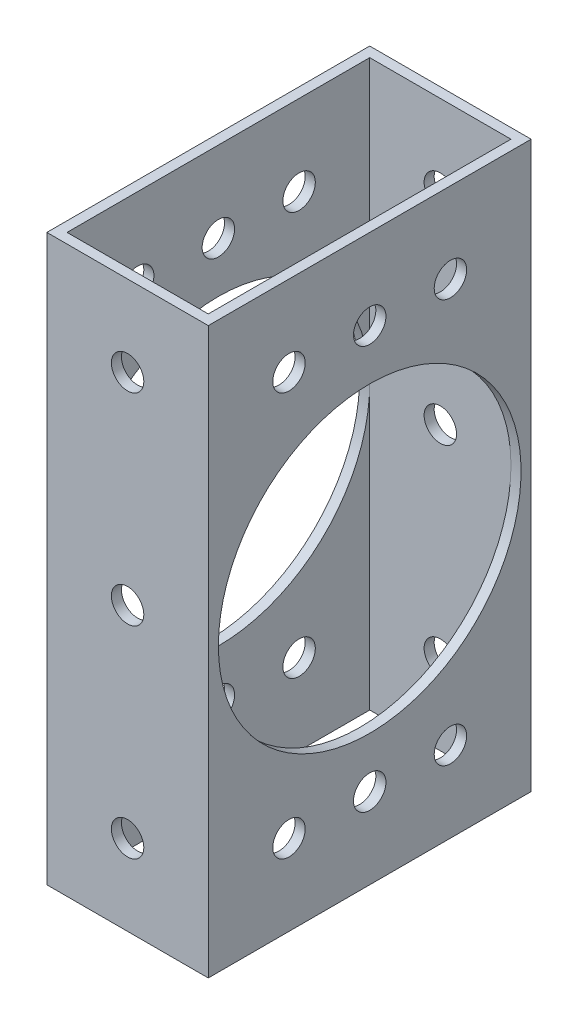
ISO-10303-21;
HEADER;
FILE_DESCRIPTION(('STEP AP214'),'2;1');
FILE_NAME('part.step','',(''),(''),'','','');
FILE_SCHEMA(('AUTOMOTIVE_DESIGN { 1 0 10303 214 1 1 1 1 }'));
ENDSEC;
DATA;
#1=APPLICATION_CONTEXT('core data for automotive mechanical design processes');
#2=APPLICATION_PROTOCOL_DEFINITION('international standard','automotive_design',2000,#1);
#3=PRODUCT_CONTEXT('',#1,'mechanical');
#4=PRODUCT('Part','Part','',(#3));
#5=PRODUCT_RELATED_PRODUCT_CATEGORY('part','',(#4));
#6=PRODUCT_DEFINITION_FORMATION('','',#4);
#7=PRODUCT_DEFINITION_CONTEXT('part definition',#1,'design');
#8=PRODUCT_DEFINITION('design','',#6,#7);
#9=PRODUCT_DEFINITION_SHAPE('','',#8);
#10=(LENGTH_UNIT() NAMED_UNIT(*) SI_UNIT(.MILLI.,.METRE.));
#11=(NAMED_UNIT(*) PLANE_ANGLE_UNIT() SI_UNIT($,.RADIAN.));
#12=(NAMED_UNIT(*) SI_UNIT($,.STERADIAN.) SOLID_ANGLE_UNIT());
#13=UNCERTAINTY_MEASURE_WITH_UNIT(LENGTH_MEASURE(1.E-05),#10,'distance_accuracy_value','');
#14=(GEOMETRIC_REPRESENTATION_CONTEXT(3) GLOBAL_UNCERTAINTY_ASSIGNED_CONTEXT((#13)) GLOBAL_UNIT_ASSIGNED_CONTEXT((#10,
#11,#12)) REPRESENTATION_CONTEXT('',''));
#15=CARTESIAN_POINT('',(0.,0.,0.));
#16=DIRECTION('',(0.,0.,1.));
#17=DIRECTION('',(1.,0.,0.));
#18=AXIS2_PLACEMENT_3D('',#15,#16,#17);
#19=CARTESIAN_POINT('',(11.1125,145.696126628495,0.));
#20=DIRECTION('',(-1.,0.,0.));
#21=DIRECTION('',(0.,0.,1.));
#22=AXIS2_PLACEMENT_3D('',#19,#20,#21);
#23=PLANE('',#22);
#24=CARTESIAN_POINT('',(11.1125,44.45,0.));
#25=DIRECTION('',(-1.,0.,0.));
#26=DIRECTION('',(0.,0.,1.));
#27=AXIS2_PLACEMENT_3D('',#24,#25,#26);
#28=CIRCLE('',#27,23.8125);
#29=CARTESIAN_POINT('',(11.1125,44.45,23.8125));
#30=VERTEX_POINT('',#29);
#31=CARTESIAN_POINT('',(11.1125,44.45,-23.8125));
#32=VERTEX_POINT('',#31);
#33=EDGE_CURVE('E91',#30,#32,#28,.T.);
#34=ORIENTED_EDGE('',*,*,#33,.F.);
#35=DIRECTION('',(0.,-1.,0.));
#36=VECTOR('',#35,1.);
#37=CARTESIAN_POINT('',(11.1125,145.696126628495,23.8125));
#38=LINE('',#37,#36);
#39=CARTESIAN_POINT('',(11.1125,88.9,23.8125));
#40=VERTEX_POINT('',#39);
#41=EDGE_CURVE('E233',#40,#30,#38,.T.);
#42=ORIENTED_EDGE('',*,*,#41,.F.);
#43=DIRECTION('',(0.,0.,-1.));
#44=VECTOR('',#43,1.);
#45=CARTESIAN_POINT('',(11.1125,88.9,0.));
#46=LINE('',#45,#44);
#47=CARTESIAN_POINT('',(11.1125,88.9,-23.8125));
#48=VERTEX_POINT('',#47);
#49=EDGE_CURVE('E459',#40,#48,#46,.T.);
#50=ORIENTED_EDGE('',*,*,#49,.T.);
#51=DIRECTION('',(0.,-1.,0.));
#52=VECTOR('',#51,1.);
#53=CARTESIAN_POINT('',(11.1125,145.696126628495,-23.8125));
#54=LINE('',#53,#52);
#55=EDGE_CURVE('E225',#48,#32,#54,.T.);
#56=ORIENTED_EDGE('',*,*,#55,.T.);
#57=EDGE_LOOP('',(#34,#42,#50,#56));
#58=FACE_BOUND('',#57,.T.);
#59=CARTESIAN_POINT('',(11.1125,76.2,12.7));
#60=DIRECTION('',(-1.,0.,0.));
#61=DIRECTION('',(0.,0.,1.));
#62=AXIS2_PLACEMENT_3D('',#59,#60,#61);
#63=CIRCLE('',#62,2.55269999999999);
#64=CARTESIAN_POINT('',(11.1125,76.2,15.2527));
#65=VERTEX_POINT('',#64);
#66=EDGE_CURVE('E273',#65,#65,#63,.T.);
#67=ORIENTED_EDGE('',*,*,#66,.F.);
#68=EDGE_LOOP('',(#67));
#69=FACE_BOUND('',#68,.T.);
#70=CARTESIAN_POINT('',(11.1125,76.2,0.));
#71=DIRECTION('',(-1.,0.,0.));
#72=DIRECTION('',(0.,0.,1.));
#73=AXIS2_PLACEMENT_3D('',#70,#71,#72);
#74=CIRCLE('',#73,2.55269999999999);
#75=CARTESIAN_POINT('',(11.1125,76.2,2.55269999999999));
#76=VERTEX_POINT('',#75);
#77=EDGE_CURVE('E403',#76,#76,#74,.T.);
#78=ORIENTED_EDGE('',*,*,#77,.F.);
#79=EDGE_LOOP('',(#78));
#80=FACE_BOUND('',#79,.T.);
#81=CARTESIAN_POINT('',(11.1125,76.2,-12.7));
#82=DIRECTION('',(-1.,0.,0.));
#83=DIRECTION('',(0.,0.,1.));
#84=AXIS2_PLACEMENT_3D('',#81,#82,#83);
#85=CIRCLE('',#84,2.55269999999999);
#86=CARTESIAN_POINT('',(11.1125,76.2,-10.1473));
#87=VERTEX_POINT('',#86);
#88=EDGE_CURVE('E387',#87,#87,#85,.T.);
#89=ORIENTED_EDGE('',*,*,#88,.F.);
#90=EDGE_LOOP('',(#89));
#91=FACE_BOUND('',#90,.T.);
#92=ADVANCED_FACE('F71',(#58,#69,#80,#91),#23,.T.);
#93=CARTESIAN_POINT('',(-11.1125,145.696126628495,0.));
#94=DIRECTION('',(1.,0.,0.));
#95=DIRECTION('',(0.,0.,-1.));
#96=AXIS2_PLACEMENT_3D('',#93,#94,#95);
#97=PLANE('',#96);
#98=CARTESIAN_POINT('',(-11.1125,44.45,0.));
#99=DIRECTION('',(1.,0.,0.));
#100=DIRECTION('',(0.,0.,-1.));
#101=AXIS2_PLACEMENT_3D('',#98,#99,#100);
#102=CIRCLE('',#101,23.8125);
#103=CARTESIAN_POINT('',(-11.1125,44.45,-23.8125));
#104=VERTEX_POINT('',#103);
#105=CARTESIAN_POINT('',(-11.1125,44.45,23.8125));
#106=VERTEX_POINT('',#105);
#107=EDGE_CURVE('E100',#104,#106,#102,.T.);
#108=ORIENTED_EDGE('',*,*,#107,.F.);
#109=DIRECTION('',(0.,-1.,0.));
#110=VECTOR('',#109,1.);
#111=CARTESIAN_POINT('',(-11.1125,145.696126628495,-23.8125));
#112=LINE('',#111,#110);
#113=CARTESIAN_POINT('',(-11.1125,88.9,-23.8125));
#114=VERTEX_POINT('',#113);
#115=EDGE_CURVE('E200',#114,#104,#112,.T.);
#116=ORIENTED_EDGE('',*,*,#115,.F.);
#117=DIRECTION('',(0.,0.,1.));
#118=VECTOR('',#117,1.);
#119=CARTESIAN_POINT('',(-11.1125,88.9,0.));
#120=LINE('',#119,#118);
#121=CARTESIAN_POINT('',(-11.1125,88.9,23.8125));
#122=VERTEX_POINT('',#121);
#123=EDGE_CURVE('E467',#114,#122,#120,.T.);
#124=ORIENTED_EDGE('',*,*,#123,.T.);
#125=DIRECTION('',(0.,-1.,0.));
#126=VECTOR('',#125,1.);
#127=CARTESIAN_POINT('',(-11.1125,145.696126628495,23.8125));
#128=LINE('',#127,#126);
#129=EDGE_CURVE('E202',#122,#106,#128,.T.);
#130=ORIENTED_EDGE('',*,*,#129,.T.);
#131=EDGE_LOOP('',(#108,#116,#124,#130));
#132=FACE_BOUND('',#131,.T.);
#133=CARTESIAN_POINT('',(-11.1125,76.2,12.7));
#134=DIRECTION('',(1.,0.,0.));
#135=DIRECTION('',(0.,0.,-1.));
#136=AXIS2_PLACEMENT_3D('',#133,#134,#135);
#137=CIRCLE('',#136,2.55269999999999);
#138=CARTESIAN_POINT('',(-11.1125,76.2,10.1473));
#139=VERTEX_POINT('',#138);
#140=EDGE_CURVE('E277',#139,#139,#137,.T.);
#141=ORIENTED_EDGE('',*,*,#140,.F.);
#142=EDGE_LOOP('',(#141));
#143=FACE_BOUND('',#142,.T.);
#144=CARTESIAN_POINT('',(-11.1125,76.2,0.));
#145=DIRECTION('',(1.,0.,0.));
#146=DIRECTION('',(0.,0.,-1.));
#147=AXIS2_PLACEMENT_3D('',#144,#145,#146);
#148=CIRCLE('',#147,2.55269999999999);
#149=CARTESIAN_POINT('',(-11.1125,76.2,-2.55269999999999));
#150=VERTEX_POINT('',#149);
#151=EDGE_CURVE('E399',#150,#150,#148,.T.);
#152=ORIENTED_EDGE('',*,*,#151,.F.);
#153=EDGE_LOOP('',(#152));
#154=FACE_BOUND('',#153,.T.);
#155=CARTESIAN_POINT('',(-11.1125,76.2,-12.7));
#156=DIRECTION('',(1.,0.,0.));
#157=DIRECTION('',(0.,0.,-1.));
#158=AXIS2_PLACEMENT_3D('',#155,#156,#157);
#159=CIRCLE('',#158,2.55269999999999);
#160=CARTESIAN_POINT('',(-11.1125,76.2,-15.2527));
#161=VERTEX_POINT('',#160);
#162=EDGE_CURVE('E383',#161,#161,#159,.T.);
#163=ORIENTED_EDGE('',*,*,#162,.F.);
#164=EDGE_LOOP('',(#163));
#165=FACE_BOUND('',#164,.T.);
#166=ADVANCED_FACE('F196',(#132,#143,#154,#165),#97,.T.);
#167=CARTESIAN_POINT('',(12.7,145.696126628495,-25.4));
#168=DIRECTION('',(0.,0.,1.));
#169=DIRECTION('',(1.,0.,0.));
#170=AXIS2_PLACEMENT_3D('',#167,#168,#169);
#171=PLANE('',#170);
#172=CARTESIAN_POINT('',(0.,12.7,-25.4));
#173=DIRECTION('',(0.,0.,1.));
#174=DIRECTION('',(1.,0.,0.));
#175=AXIS2_PLACEMENT_3D('',#172,#173,#174);
#176=CIRCLE('',#175,2.55269999999999);
#177=CARTESIAN_POINT('',(2.55269999999999,12.7,-25.4));
#178=VERTEX_POINT('',#177);
#179=EDGE_CURVE('E516',#178,#178,#176,.T.);
#180=ORIENTED_EDGE('',*,*,#179,.T.);
#181=EDGE_LOOP('',(#180));
#182=FACE_BOUND('',#181,.T.);
#183=CARTESIAN_POINT('',(0.,76.2,-25.4));
#184=DIRECTION('',(0.,0.,1.));
#185=DIRECTION('',(1.,0.,0.));
#186=AXIS2_PLACEMENT_3D('',#183,#184,#185);
#187=CIRCLE('',#186,2.55269999999999);
#188=CARTESIAN_POINT('',(2.55269999999999,76.2,-25.4));
#189=VERTEX_POINT('',#188);
#190=EDGE_CURVE('E539',#189,#189,#187,.T.);
#191=ORIENTED_EDGE('',*,*,#190,.T.);
#192=EDGE_LOOP('',(#191));
#193=FACE_BOUND('',#192,.T.);
#194=CARTESIAN_POINT('',(0.,44.45,-25.4));
#195=DIRECTION('',(0.,0.,1.));
#196=DIRECTION('',(1.,0.,0.));
#197=AXIS2_PLACEMENT_3D('',#194,#195,#196);
#198=CIRCLE('',#197,2.55269999999999);
#199=CARTESIAN_POINT('',(2.55269999999999,44.45,-25.4));
#200=VERTEX_POINT('',#199);
#201=EDGE_CURVE('E364',#200,#200,#198,.T.);
#202=ORIENTED_EDGE('',*,*,#201,.T.);
#203=EDGE_LOOP('',(#202));
#204=FACE_BOUND('',#203,.T.);
#205=DIRECTION('',(-1.,0.,0.));
#206=VECTOR('',#205,1.);
#207=CARTESIAN_POINT('',(12.7,88.9,-25.4));
#208=LINE('',#207,#206);
#209=CARTESIAN_POINT('',(12.7,88.9,-25.4));
#210=VERTEX_POINT('',#209);
#211=CARTESIAN_POINT('',(-12.7,88.9,-25.4));
#212=VERTEX_POINT('',#211);
#213=EDGE_CURVE('E470',#210,#212,#208,.T.);
#214=ORIENTED_EDGE('',*,*,#213,.F.);
#215=DIRECTION('',(0.,-1.,0.));
#216=VECTOR('',#215,1.);
#217=CARTESIAN_POINT('',(12.7,145.696126628495,-25.4));
#218=LINE('',#217,#216);
#219=CARTESIAN_POINT('',(12.7,0.,-25.4));
#220=VERTEX_POINT('',#219);
#221=EDGE_CURVE('E259',#210,#220,#218,.T.);
#222=ORIENTED_EDGE('',*,*,#221,.T.);
#223=DIRECTION('',(-1.,0.,0.));
#224=VECTOR('',#223,1.);
#225=CARTESIAN_POINT('',(12.7,0.,-25.4));
#226=LINE('',#225,#224);
#227=CARTESIAN_POINT('',(-12.7,0.,-25.4));
#228=VERTEX_POINT('',#227);
#229=EDGE_CURVE('E252',#220,#228,#226,.T.);
#230=ORIENTED_EDGE('',*,*,#229,.T.);
#231=DIRECTION('',(0.,-1.,0.));
#232=VECTOR('',#231,1.);
#233=CARTESIAN_POINT('',(-12.7,145.696126628495,-25.4));
#234=LINE('',#233,#232);
#235=EDGE_CURVE('E256',#212,#228,#234,.T.);
#236=ORIENTED_EDGE('',*,*,#235,.F.);
#237=EDGE_LOOP('',(#214,#222,#230,#236));
#238=FACE_BOUND('',#237,.T.);
#239=ADVANCED_FACE('F571',(#182,#193,#204,#238),#171,.F.);
#240=CARTESIAN_POINT('',(12.7,145.696126628495,-25.4));
#241=DIRECTION('',(-1.,0.,0.));
#242=DIRECTION('',(0.,0.,1.));
#243=AXIS2_PLACEMENT_3D('',#240,#241,#242);
#244=PLANE('',#243);
#245=CARTESIAN_POINT('',(12.7,44.45,0.));
#246=DIRECTION('',(-1.,0.,0.));
#247=DIRECTION('',(0.,0.,1.));
#248=AXIS2_PLACEMENT_3D('',#245,#246,#247);
#249=CIRCLE('',#248,23.8125);
#250=CARTESIAN_POINT('',(12.7,44.45,23.8125));
#251=VERTEX_POINT('',#250);
#252=EDGE_CURVE('E191',#251,#251,#249,.T.);
#253=ORIENTED_EDGE('',*,*,#252,.T.);
#254=EDGE_LOOP('',(#253));
#255=FACE_BOUND('',#254,.T.);
#256=CARTESIAN_POINT('',(12.7,76.2,-12.7));
#257=DIRECTION('',(-1.,0.,0.));
#258=DIRECTION('',(0.,0.,1.));
#259=AXIS2_PLACEMENT_3D('',#256,#257,#258);
#260=CIRCLE('',#259,2.55269999999999);
#261=CARTESIAN_POINT('',(12.7,76.2,-10.1473));
#262=VERTEX_POINT('',#261);
#263=EDGE_CURVE('E379',#262,#262,#260,.T.);
#264=ORIENTED_EDGE('',*,*,#263,.T.);
#265=EDGE_LOOP('',(#264));
#266=FACE_BOUND('',#265,.T.);
#267=CARTESIAN_POINT('',(12.7,76.2,0.));
#268=DIRECTION('',(-1.,0.,0.));
#269=DIRECTION('',(0.,0.,1.));
#270=AXIS2_PLACEMENT_3D('',#267,#268,#269);
#271=CIRCLE('',#270,2.55269999999999);
#272=CARTESIAN_POINT('',(12.7,76.2,2.55269999999999));
#273=VERTEX_POINT('',#272);
#274=EDGE_CURVE('E395',#273,#273,#271,.T.);
#275=ORIENTED_EDGE('',*,*,#274,.T.);
#276=EDGE_LOOP('',(#275));
#277=FACE_BOUND('',#276,.T.);
#278=CARTESIAN_POINT('',(12.7,76.2,12.7));
#279=DIRECTION('',(-1.,0.,0.));
#280=DIRECTION('',(0.,0.,1.));
#281=AXIS2_PLACEMENT_3D('',#278,#279,#280);
#282=CIRCLE('',#281,2.55269999999999);
#283=CARTESIAN_POINT('',(12.7,76.2,15.2527));
#284=VERTEX_POINT('',#283);
#285=EDGE_CURVE('E278',#284,#284,#282,.T.);
#286=ORIENTED_EDGE('',*,*,#285,.T.);
#287=EDGE_LOOP('',(#286));
#288=FACE_BOUND('',#287,.T.);
#289=CARTESIAN_POINT('',(12.7,12.7,-12.7));
#290=DIRECTION('',(-1.,0.,0.));
#291=DIRECTION('',(0.,0.,1.));
#292=AXIS2_PLACEMENT_3D('',#289,#290,#291);
#293=CIRCLE('',#292,2.55269999999999);
#294=CARTESIAN_POINT('',(12.7,12.7,-10.1473));
#295=VERTEX_POINT('',#294);
#296=EDGE_CURVE('E272',#295,#295,#293,.T.);
#297=ORIENTED_EDGE('',*,*,#296,.T.);
#298=EDGE_LOOP('',(#297));
#299=FACE_BOUND('',#298,.T.);
#300=CARTESIAN_POINT('',(12.7,12.7,0.));
#301=DIRECTION('',(-1.,0.,0.));
#302=DIRECTION('',(0.,0.,1.));
#303=AXIS2_PLACEMENT_3D('',#300,#301,#302);
#304=CIRCLE('',#303,2.55269999999999);
#305=CARTESIAN_POINT('',(12.7,12.7,2.55269999999999));
#306=VERTEX_POINT('',#305);
#307=EDGE_CURVE('E431',#306,#306,#304,.T.);
#308=ORIENTED_EDGE('',*,*,#307,.T.);
#309=EDGE_LOOP('',(#308));
#310=FACE_BOUND('',#309,.T.);
#311=CARTESIAN_POINT('',(12.7,12.7,12.7));
#312=DIRECTION('',(-1.,0.,0.));
#313=DIRECTION('',(0.,0.,1.));
#314=AXIS2_PLACEMENT_3D('',#311,#312,#313);
#315=CIRCLE('',#314,2.55269999999999);
#316=CARTESIAN_POINT('',(12.7,12.7,15.2527));
#317=VERTEX_POINT('',#316);
#318=EDGE_CURVE('E447',#317,#317,#315,.T.);
#319=ORIENTED_EDGE('',*,*,#318,.T.);
#320=EDGE_LOOP('',(#319));
#321=FACE_BOUND('',#320,.T.);
#322=DIRECTION('',(0.,0.,-1.));
#323=VECTOR('',#322,1.);
#324=CARTESIAN_POINT('',(12.7,88.9,-25.4));
#325=LINE('',#324,#323);
#326=CARTESIAN_POINT('',(12.7,88.9,25.4));
#327=VERTEX_POINT('',#326);
#328=EDGE_CURVE('E474',#327,#210,#325,.T.);
#329=ORIENTED_EDGE('',*,*,#328,.F.);
#330=DIRECTION('',(0.,-1.,0.));
#331=VECTOR('',#330,1.);
#332=CARTESIAN_POINT('',(12.7,145.696126628495,25.4));
#333=LINE('',#332,#331);
#334=CARTESIAN_POINT('',(12.7,0.,25.4));
#335=VERTEX_POINT('',#334);
#336=EDGE_CURVE('E262',#327,#335,#333,.T.);
#337=ORIENTED_EDGE('',*,*,#336,.T.);
#338=DIRECTION('',(0.,0.,-1.));
#339=VECTOR('',#338,1.);
#340=CARTESIAN_POINT('',(12.7,0.,-25.4));
#341=LINE('',#340,#339);
#342=EDGE_CURVE('E248',#335,#220,#341,.T.);
#343=ORIENTED_EDGE('',*,*,#342,.T.);
#344=ORIENTED_EDGE('',*,*,#221,.F.);
#345=EDGE_LOOP('',(#329,#337,#343,#344));
#346=FACE_BOUND('',#345,.T.);
#347=ADVANCED_FACE('F559',(#255,#266,#277,#288,#299,#310,#321,#346),#244,.F.);
#348=CARTESIAN_POINT('',(12.7,145.696126628495,25.4));
#349=DIRECTION('',(0.,0.,-1.));
#350=DIRECTION('',(-1.,0.,0.));
#351=AXIS2_PLACEMENT_3D('',#348,#349,#350);
#352=PLANE('',#351);
#353=CARTESIAN_POINT('',(0.,12.7,25.4));
#354=DIRECTION('',(0.,0.,1.));
#355=DIRECTION('',(1.,0.,0.));
#356=AXIS2_PLACEMENT_3D('',#353,#354,#355);
#357=CIRCLE('',#356,2.55269999999999);
#358=CARTESIAN_POINT('',(2.55269999999999,12.7,25.4));
#359=VERTEX_POINT('',#358);
#360=EDGE_CURVE('E518',#359,#359,#357,.T.);
#361=ORIENTED_EDGE('',*,*,#360,.F.);
#362=EDGE_LOOP('',(#361));
#363=FACE_BOUND('',#362,.T.);
#364=CARTESIAN_POINT('',(0.,76.2,25.4));
#365=DIRECTION('',(0.,0.,1.));
#366=DIRECTION('',(1.,0.,0.));
#367=AXIS2_PLACEMENT_3D('',#364,#365,#366);
#368=CIRCLE('',#367,2.55269999999999);
#369=CARTESIAN_POINT('',(2.55269999999999,76.2,25.4));
#370=VERTEX_POINT('',#369);
#371=EDGE_CURVE('E513',#370,#370,#368,.T.);
#372=ORIENTED_EDGE('',*,*,#371,.F.);
#373=EDGE_LOOP('',(#372));
#374=FACE_BOUND('',#373,.T.);
#375=CARTESIAN_POINT('',(0.,44.45,25.4));
#376=DIRECTION('',(0.,0.,1.));
#377=DIRECTION('',(1.,0.,0.));
#378=AXIS2_PLACEMENT_3D('',#375,#376,#377);
#379=CIRCLE('',#378,2.55269999999999);
#380=CARTESIAN_POINT('',(2.55269999999999,44.45,25.4));
#381=VERTEX_POINT('',#380);
#382=EDGE_CURVE('E366',#381,#381,#379,.T.);
#383=ORIENTED_EDGE('',*,*,#382,.F.);
#384=EDGE_LOOP('',(#383));
#385=FACE_BOUND('',#384,.T.);
#386=DIRECTION('',(1.,0.,0.));
#387=VECTOR('',#386,1.);
#388=CARTESIAN_POINT('',(12.7,88.9,25.4));
#389=LINE('',#388,#387);
#390=CARTESIAN_POINT('',(-12.7,88.9,25.4));
#391=VERTEX_POINT('',#390);
#392=EDGE_CURVE('E478',#391,#327,#389,.T.);
#393=ORIENTED_EDGE('',*,*,#392,.F.);
#394=DIRECTION('',(0.,-1.,0.));
#395=VECTOR('',#394,1.);
#396=CARTESIAN_POINT('',(-12.7,145.696126628495,25.4));
#397=LINE('',#396,#395);
#398=CARTESIAN_POINT('',(-12.7,0.,25.4));
#399=VERTEX_POINT('',#398);
#400=EDGE_CURVE('E81',#391,#399,#397,.T.);
#401=ORIENTED_EDGE('',*,*,#400,.T.);
#402=DIRECTION('',(1.,0.,0.));
#403=VECTOR('',#402,1.);
#404=CARTESIAN_POINT('',(12.7,0.,25.4));
#405=LINE('',#404,#403);
#406=EDGE_CURVE('E244',#399,#335,#405,.T.);
#407=ORIENTED_EDGE('',*,*,#406,.T.);
#408=ORIENTED_EDGE('',*,*,#336,.F.);
#409=EDGE_LOOP('',(#393,#401,#407,#408));
#410=FACE_BOUND('',#409,.T.);
#411=ADVANCED_FACE('F556',(#363,#374,#385,#410),#352,.F.);
#412=CARTESIAN_POINT('',(-12.7,145.696126628495,-25.4));
#413=DIRECTION('',(1.,0.,0.));
#414=DIRECTION('',(0.,0.,-1.));
#415=AXIS2_PLACEMENT_3D('',#412,#413,#414);
#416=PLANE('',#415);
#417=CARTESIAN_POINT('',(-12.7,44.45,0.));
#418=DIRECTION('',(-1.,0.,0.));
#419=DIRECTION('',(0.,0.,1.));
#420=AXIS2_PLACEMENT_3D('',#417,#418,#419);
#421=CIRCLE('',#420,23.8125);
#422=CARTESIAN_POINT('',(-12.7,44.45,23.8125));
#423=VERTEX_POINT('',#422);
#424=EDGE_CURVE('E522',#423,#423,#421,.T.);
#425=ORIENTED_EDGE('',*,*,#424,.F.);
#426=EDGE_LOOP('',(#425));
#427=FACE_BOUND('',#426,.T.);
#428=CARTESIAN_POINT('',(-12.7,76.2,-12.7));
#429=DIRECTION('',(-1.,0.,0.));
#430=DIRECTION('',(0.,0.,1.));
#431=AXIS2_PLACEMENT_3D('',#428,#429,#430);
#432=CIRCLE('',#431,2.55269999999999);
#433=CARTESIAN_POINT('',(-12.7,76.2,-10.1473));
#434=VERTEX_POINT('',#433);
#435=EDGE_CURVE('E361',#434,#434,#432,.T.);
#436=ORIENTED_EDGE('',*,*,#435,.F.);
#437=EDGE_LOOP('',(#436));
#438=FACE_BOUND('',#437,.T.);
#439=CARTESIAN_POINT('',(-12.7,76.2,0.));
#440=DIRECTION('',(-1.,0.,0.));
#441=DIRECTION('',(0.,0.,1.));
#442=AXIS2_PLACEMENT_3D('',#439,#440,#441);
#443=CIRCLE('',#442,2.55269999999999);
#444=CARTESIAN_POINT('',(-12.7,76.2,2.55269999999999));
#445=VERTEX_POINT('',#444);
#446=EDGE_CURVE('E391',#445,#445,#443,.T.);
#447=ORIENTED_EDGE('',*,*,#446,.F.);
#448=EDGE_LOOP('',(#447));
#449=FACE_BOUND('',#448,.T.);
#450=CARTESIAN_POINT('',(-12.7,76.2,12.7));
#451=DIRECTION('',(-1.,0.,0.));
#452=DIRECTION('',(0.,0.,1.));
#453=AXIS2_PLACEMENT_3D('',#450,#451,#452);
#454=CIRCLE('',#453,2.55269999999999);
#455=CARTESIAN_POINT('',(-12.7,76.2,15.2527));
#456=VERTEX_POINT('',#455);
#457=EDGE_CURVE('E407',#456,#456,#454,.T.);
#458=ORIENTED_EDGE('',*,*,#457,.F.);
#459=EDGE_LOOP('',(#458));
#460=FACE_BOUND('',#459,.T.);
#461=CARTESIAN_POINT('',(-12.7,12.7,-12.7));
#462=DIRECTION('',(-1.,0.,0.));
#463=DIRECTION('',(0.,0.,1.));
#464=AXIS2_PLACEMENT_3D('',#461,#462,#463);
#465=CIRCLE('',#464,2.55269999999999);
#466=CARTESIAN_POINT('',(-12.7,12.7,-10.1473));
#467=VERTEX_POINT('',#466);
#468=EDGE_CURVE('E417',#467,#467,#465,.T.);
#469=ORIENTED_EDGE('',*,*,#468,.F.);
#470=EDGE_LOOP('',(#469));
#471=FACE_BOUND('',#470,.T.);
#472=CARTESIAN_POINT('',(-12.7,12.7,0.));
#473=DIRECTION('',(-1.,0.,0.));
#474=DIRECTION('',(0.,0.,1.));
#475=AXIS2_PLACEMENT_3D('',#472,#473,#474);
#476=CIRCLE('',#475,2.55269999999999);
#477=CARTESIAN_POINT('',(-12.7,12.7,2.55269999999999));
#478=VERTEX_POINT('',#477);
#479=EDGE_CURVE('E427',#478,#478,#476,.T.);
#480=ORIENTED_EDGE('',*,*,#479,.F.);
#481=EDGE_LOOP('',(#480));
#482=FACE_BOUND('',#481,.T.);
#483=CARTESIAN_POINT('',(-12.7,12.7,12.7));
#484=DIRECTION('',(-1.,0.,0.));
#485=DIRECTION('',(0.,0.,1.));
#486=AXIS2_PLACEMENT_3D('',#483,#484,#485);
#487=CIRCLE('',#486,2.55269999999999);
#488=CARTESIAN_POINT('',(-12.7,12.7,15.2527));
#489=VERTEX_POINT('',#488);
#490=EDGE_CURVE('E443',#489,#489,#487,.T.);
#491=ORIENTED_EDGE('',*,*,#490,.F.);
#492=EDGE_LOOP('',(#491));
#493=FACE_BOUND('',#492,.T.);
#494=DIRECTION('',(0.,0.,1.));
#495=VECTOR('',#494,1.);
#496=CARTESIAN_POINT('',(-12.7,88.9,-25.4));
#497=LINE('',#496,#495);
#498=EDGE_CURVE('E482',#212,#391,#497,.T.);
#499=ORIENTED_EDGE('',*,*,#498,.F.);
#500=ORIENTED_EDGE('',*,*,#235,.T.);
#501=DIRECTION('',(0.,0.,1.));
#502=VECTOR('',#501,1.);
#503=CARTESIAN_POINT('',(-12.7,0.,-25.4));
#504=LINE('',#503,#502);
#505=EDGE_CURVE('E240',#228,#399,#504,.T.);
#506=ORIENTED_EDGE('',*,*,#505,.T.);
#507=ORIENTED_EDGE('',*,*,#400,.F.);
#508=EDGE_LOOP('',(#499,#500,#506,#507));
#509=FACE_BOUND('',#508,.T.);
#510=ADVANCED_FACE('F73',(#427,#438,#449,#460,#471,#482,#493,#509),#416,.F.);
#511=CARTESIAN_POINT('',(0.,0.,0.));
#512=DIRECTION('',(0.,1.,0.));
#513=DIRECTION('',(0.,0.,1.));
#514=AXIS2_PLACEMENT_3D('',#511,#512,#513);
#515=PLANE('',#514);
#516=ORIENTED_EDGE('',*,*,#505,.F.);
#517=ORIENTED_EDGE('',*,*,#229,.F.);
#518=ORIENTED_EDGE('',*,*,#342,.F.);
#519=ORIENTED_EDGE('',*,*,#406,.F.);
#520=EDGE_LOOP('',(#516,#517,#518,#519));
#521=FACE_BOUND('',#520,.T.);
#522=DIRECTION('',(0.,0.,1.));
#523=VECTOR('',#522,1.);
#524=CARTESIAN_POINT('',(-11.1125,0.,0.));
#525=LINE('',#524,#523);
#526=CARTESIAN_POINT('',(-11.1125,0.,-23.8125));
#527=VERTEX_POINT('',#526);
#528=CARTESIAN_POINT('',(-11.1125,0.,23.8125));
#529=VERTEX_POINT('',#528);
#530=EDGE_CURVE('E210',#527,#529,#525,.T.);
#531=ORIENTED_EDGE('',*,*,#530,.T.);
#532=DIRECTION('',(1.,0.,0.));
#533=VECTOR('',#532,1.);
#534=CARTESIAN_POINT('',(0.,0.,23.8125));
#535=LINE('',#534,#533);
#536=CARTESIAN_POINT('',(11.1125,0.,23.8125));
#537=VERTEX_POINT('',#536);
#538=EDGE_CURVE('E488',#529,#537,#535,.T.);
#539=ORIENTED_EDGE('',*,*,#538,.T.);
#540=DIRECTION('',(0.,0.,-1.));
#541=VECTOR('',#540,1.);
#542=CARTESIAN_POINT('',(11.1125,0.,0.));
#543=LINE('',#542,#541);
#544=CARTESIAN_POINT('',(11.1125,0.,-23.8125));
#545=VERTEX_POINT('',#544);
#546=EDGE_CURVE('E491',#537,#545,#543,.T.);
#547=ORIENTED_EDGE('',*,*,#546,.T.);
#548=DIRECTION('',(-1.,0.,0.));
#549=VECTOR('',#548,1.);
#550=CARTESIAN_POINT('',(0.,0.,-23.8125));
#551=LINE('',#550,#549);
#552=EDGE_CURVE('E215',#545,#527,#551,.T.);
#553=ORIENTED_EDGE('',*,*,#552,.T.);
#554=EDGE_LOOP('',(#531,#539,#547,#553));
#555=FACE_BOUND('',#554,.T.);
#556=ADVANCED_FACE('F337',(#521,#555),#515,.F.);
#557=CARTESIAN_POINT('',(0.,145.696126628495,-23.8125));
#558=DIRECTION('',(0.,0.,1.));
#559=DIRECTION('',(1.,0.,0.));
#560=AXIS2_PLACEMENT_3D('',#557,#558,#559);
#561=PLANE('',#560);
#562=CARTESIAN_POINT('',(0.,44.45,-23.8125));
#563=DIRECTION('',(0.,0.,1.));
#564=DIRECTION('',(1.,0.,0.));
#565=AXIS2_PLACEMENT_3D('',#562,#563,#564);
#566=CIRCLE('',#565,2.55269999999999);
#567=CARTESIAN_POINT('',(2.55269999999999,44.45,-23.8125));
#568=VERTEX_POINT('',#567);
#569=CARTESIAN_POINT('',(-2.55269999999999,44.45,-23.8125));
#570=VERTEX_POINT('',#569);
#571=EDGE_CURVE('E322',#568,#570,#566,.T.);
#572=ORIENTED_EDGE('',*,*,#571,.F.);
#573=CARTESIAN_POINT('',(0.,44.45,-23.8125));
#574=DIRECTION('',(0.,0.,1.));
#575=DIRECTION('',(1.,0.,0.));
#576=AXIS2_PLACEMENT_3D('',#573,#574,#575);
#577=CIRCLE('',#576,2.55269999999999);
#578=EDGE_CURVE('E326',#570,#568,#577,.T.);
#579=ORIENTED_EDGE('',*,*,#578,.F.);
#580=EDGE_LOOP('',(#572,#579));
#581=FACE_BOUND('',#580,.T.);
#582=EDGE_CURVE('E222',#32,#545,#54,.T.);
#583=ORIENTED_EDGE('',*,*,#582,.F.);
#584=ORIENTED_EDGE('',*,*,#55,.F.);
#585=DIRECTION('',(-1.,0.,0.));
#586=VECTOR('',#585,1.);
#587=CARTESIAN_POINT('',(0.,88.9,-23.8125));
#588=LINE('',#587,#586);
#589=EDGE_CURVE('E12',#48,#114,#588,.T.);
#590=ORIENTED_EDGE('',*,*,#589,.T.);
#591=ORIENTED_EDGE('',*,*,#115,.T.);
#592=EDGE_CURVE('E206',#104,#527,#112,.T.);
#593=ORIENTED_EDGE('',*,*,#592,.T.);
#594=ORIENTED_EDGE('',*,*,#552,.F.);
#595=EDGE_LOOP('',(#583,#584,#590,#591,#593,#594));
#596=FACE_BOUND('',#595,.T.);
#597=CARTESIAN_POINT('',(0.,76.2,-23.8125));
#598=DIRECTION('',(0.,0.,1.));
#599=DIRECTION('',(1.,0.,0.));
#600=AXIS2_PLACEMENT_3D('',#597,#598,#599);
#601=CIRCLE('',#600,2.55269999999999);
#602=CARTESIAN_POINT('',(2.55269999999999,76.2,-23.8125));
#603=VERTEX_POINT('',#602);
#604=EDGE_CURVE('E543',#603,#603,#601,.T.);
#605=ORIENTED_EDGE('',*,*,#604,.F.);
#606=EDGE_LOOP('',(#605));
#607=FACE_BOUND('',#606,.T.);
#608=CARTESIAN_POINT('',(0.,12.7,-23.8125));
#609=DIRECTION('',(0.,0.,1.));
#610=DIRECTION('',(1.,0.,0.));
#611=AXIS2_PLACEMENT_3D('',#608,#609,#610);
#612=CIRCLE('',#611,2.55269999999999);
#613=CARTESIAN_POINT('',(2.55269999999999,12.7,-23.8125));
#614=VERTEX_POINT('',#613);
#615=EDGE_CURVE('E510',#614,#614,#612,.T.);
#616=ORIENTED_EDGE('',*,*,#615,.F.);
#617=EDGE_LOOP('',(#616));
#618=FACE_BOUND('',#617,.T.);
#619=ADVANCED_FACE('F218',(#581,#596,#607,#618),#561,.T.);
#620=EDGE_CURVE('E204',#32,#30,#28,.T.);
#621=ORIENTED_EDGE('',*,*,#620,.F.);
#622=ORIENTED_EDGE('',*,*,#582,.T.);
#623=ORIENTED_EDGE('',*,*,#546,.F.);
#624=EDGE_CURVE('E232',#30,#537,#38,.T.);
#625=ORIENTED_EDGE('',*,*,#624,.F.);
#626=EDGE_LOOP('',(#621,#622,#623,#625));
#627=FACE_BOUND('',#626,.T.);
#628=CARTESIAN_POINT('',(11.1125,12.7,-12.7));
#629=DIRECTION('',(-1.,0.,0.));
#630=DIRECTION('',(0.,0.,1.));
#631=AXIS2_PLACEMENT_3D('',#628,#629,#630);
#632=CIRCLE('',#631,2.55269999999999);
#633=CARTESIAN_POINT('',(11.1125,12.7,-10.1473));
#634=VERTEX_POINT('',#633);
#635=EDGE_CURVE('E267',#634,#634,#632,.T.);
#636=ORIENTED_EDGE('',*,*,#635,.F.);
#637=EDGE_LOOP('',(#636));
#638=FACE_BOUND('',#637,.T.);
#639=CARTESIAN_POINT('',(11.1125,12.7,0.));
#640=DIRECTION('',(-1.,0.,0.));
#641=DIRECTION('',(0.,0.,1.));
#642=AXIS2_PLACEMENT_3D('',#639,#640,#641);
#643=CIRCLE('',#642,2.55269999999999);
#644=CARTESIAN_POINT('',(11.1125,12.7,2.55269999999999));
#645=VERTEX_POINT('',#644);
#646=EDGE_CURVE('E439',#645,#645,#643,.T.);
#647=ORIENTED_EDGE('',*,*,#646,.F.);
#648=EDGE_LOOP('',(#647));
#649=FACE_BOUND('',#648,.T.);
#650=CARTESIAN_POINT('',(11.1125,12.7,12.7));
#651=DIRECTION('',(-1.,0.,0.));
#652=DIRECTION('',(0.,0.,1.));
#653=AXIS2_PLACEMENT_3D('',#650,#651,#652);
#654=CIRCLE('',#653,2.55269999999999);
#655=CARTESIAN_POINT('',(11.1125,12.7,15.2527));
#656=VERTEX_POINT('',#655);
#657=EDGE_CURVE('E451',#656,#656,#654,.T.);
#658=ORIENTED_EDGE('',*,*,#657,.F.);
#659=EDGE_LOOP('',(#658));
#660=FACE_BOUND('',#659,.T.);
#661=ADVANCED_FACE('F336',(#627,#638,#649,#660),#23,.T.);
#662=CARTESIAN_POINT('',(0.,145.696126628495,23.8125));
#663=DIRECTION('',(0.,0.,-1.));
#664=DIRECTION('',(-1.,0.,0.));
#665=AXIS2_PLACEMENT_3D('',#662,#663,#664);
#666=PLANE('',#665);
#667=CARTESIAN_POINT('',(0.,44.45,23.8125));
#668=DIRECTION('',(0.,0.,-1.));
#669=DIRECTION('',(-1.,0.,0.));
#670=AXIS2_PLACEMENT_3D('',#667,#668,#669);
#671=CIRCLE('',#670,2.55269999999999);
#672=CARTESIAN_POINT('',(2.55269999999999,44.45,23.8125));
#673=VERTEX_POINT('',#672);
#674=CARTESIAN_POINT('',(-2.55269999999999,44.45,23.8125));
#675=VERTEX_POINT('',#674);
#676=EDGE_CURVE('E352',#673,#675,#671,.T.);
#677=ORIENTED_EDGE('',*,*,#676,.F.);
#678=CARTESIAN_POINT('',(0.,44.45,23.8125));
#679=DIRECTION('',(0.,0.,-1.));
#680=DIRECTION('',(-1.,0.,0.));
#681=AXIS2_PLACEMENT_3D('',#678,#679,#680);
#682=CIRCLE('',#681,2.55269999999999);
#683=EDGE_CURVE('E283',#675,#673,#682,.T.);
#684=ORIENTED_EDGE('',*,*,#683,.F.);
#685=EDGE_LOOP('',(#677,#684));
#686=FACE_BOUND('',#685,.T.);
#687=ORIENTED_EDGE('',*,*,#41,.T.);
#688=ORIENTED_EDGE('',*,*,#624,.T.);
#689=ORIENTED_EDGE('',*,*,#538,.F.);
#690=EDGE_CURVE('E237',#106,#529,#128,.T.);
#691=ORIENTED_EDGE('',*,*,#690,.F.);
#692=ORIENTED_EDGE('',*,*,#129,.F.);
#693=DIRECTION('',(1.,0.,0.));
#694=VECTOR('',#693,1.);
#695=CARTESIAN_POINT('',(0.,88.9,23.8125));
#696=LINE('',#695,#694);
#697=EDGE_CURVE('E463',#122,#40,#696,.T.);
#698=ORIENTED_EDGE('',*,*,#697,.T.);
#699=EDGE_LOOP('',(#687,#688,#689,#691,#692,#698));
#700=FACE_BOUND('',#699,.T.);
#701=CARTESIAN_POINT('',(0.,12.7,23.8125));
#702=DIRECTION('',(0.,0.,-1.));
#703=DIRECTION('',(-1.,0.,0.));
#704=AXIS2_PLACEMENT_3D('',#701,#702,#703);
#705=CIRCLE('',#704,2.55269999999999);
#706=CARTESIAN_POINT('',(-2.55269999999999,12.7,23.8125));
#707=VERTEX_POINT('',#706);
#708=EDGE_CURVE('E514',#707,#707,#705,.T.);
#709=ORIENTED_EDGE('',*,*,#708,.F.);
#710=EDGE_LOOP('',(#709));
#711=FACE_BOUND('',#710,.T.);
#712=CARTESIAN_POINT('',(0.,76.2,23.8125));
#713=DIRECTION('',(0.,0.,-1.));
#714=DIRECTION('',(-1.,0.,0.));
#715=AXIS2_PLACEMENT_3D('',#712,#713,#714);
#716=CIRCLE('',#715,2.55269999999999);
#717=CARTESIAN_POINT('',(-2.55269999999999,76.2,23.8125));
#718=VERTEX_POINT('',#717);
#719=EDGE_CURVE('E372',#718,#718,#716,.T.);
#720=ORIENTED_EDGE('',*,*,#719,.F.);
#721=EDGE_LOOP('',(#720));
#722=FACE_BOUND('',#721,.T.);
#723=ADVANCED_FACE('F342',(#686,#700,#711,#722),#666,.T.);
#724=EDGE_CURVE('E184',#106,#104,#102,.T.);
#725=ORIENTED_EDGE('',*,*,#724,.F.);
#726=ORIENTED_EDGE('',*,*,#690,.T.);
#727=ORIENTED_EDGE('',*,*,#530,.F.);
#728=ORIENTED_EDGE('',*,*,#592,.F.);
#729=EDGE_LOOP('',(#725,#726,#727,#728));
#730=FACE_BOUND('',#729,.T.);
#731=CARTESIAN_POINT('',(-11.1125,12.7,-12.7));
#732=DIRECTION('',(1.,0.,0.));
#733=DIRECTION('',(0.,0.,-1.));
#734=AXIS2_PLACEMENT_3D('',#731,#732,#733);
#735=CIRCLE('',#734,2.55269999999999);
#736=CARTESIAN_POINT('',(-11.1125,12.7,-15.2527));
#737=VERTEX_POINT('',#736);
#738=EDGE_CURVE('E271',#737,#737,#735,.T.);
#739=ORIENTED_EDGE('',*,*,#738,.F.);
#740=EDGE_LOOP('',(#739));
#741=FACE_BOUND('',#740,.T.);
#742=CARTESIAN_POINT('',(-11.1125,12.7,0.));
#743=DIRECTION('',(1.,0.,0.));
#744=DIRECTION('',(0.,0.,-1.));
#745=AXIS2_PLACEMENT_3D('',#742,#743,#744);
#746=CIRCLE('',#745,2.55269999999999);
#747=CARTESIAN_POINT('',(-11.1125,12.7,-2.55269999999999));
#748=VERTEX_POINT('',#747);
#749=EDGE_CURVE('E435',#748,#748,#746,.T.);
#750=ORIENTED_EDGE('',*,*,#749,.F.);
#751=EDGE_LOOP('',(#750));
#752=FACE_BOUND('',#751,.T.);
#753=CARTESIAN_POINT('',(-11.1125,12.7,12.7));
#754=DIRECTION('',(1.,0.,0.));
#755=DIRECTION('',(0.,0.,-1.));
#756=AXIS2_PLACEMENT_3D('',#753,#754,#755);
#757=CIRCLE('',#756,2.55269999999999);
#758=CARTESIAN_POINT('',(-11.1125,12.7,10.1473));
#759=VERTEX_POINT('',#758);
#760=EDGE_CURVE('E455',#759,#759,#757,.T.);
#761=ORIENTED_EDGE('',*,*,#760,.F.);
#762=EDGE_LOOP('',(#761));
#763=FACE_BOUND('',#762,.T.);
#764=ADVANCED_FACE('F207',(#730,#741,#752,#763),#97,.T.);
#765=CARTESIAN_POINT('',(12.7,88.9,25.4));
#766=DIRECTION('',(0.,1.,0.));
#767=DIRECTION('',(0.,0.,-1.));
#768=AXIS2_PLACEMENT_3D('',#765,#766,#767);
#769=PLANE('',#768);
#770=ORIENTED_EDGE('',*,*,#123,.F.);
#771=ORIENTED_EDGE('',*,*,#589,.F.);
#772=ORIENTED_EDGE('',*,*,#49,.F.);
#773=ORIENTED_EDGE('',*,*,#697,.F.);
#774=EDGE_LOOP('',(#770,#771,#772,#773));
#775=FACE_BOUND('',#774,.T.);
#776=ORIENTED_EDGE('',*,*,#213,.T.);
#777=ORIENTED_EDGE('',*,*,#498,.T.);
#778=ORIENTED_EDGE('',*,*,#392,.T.);
#779=ORIENTED_EDGE('',*,*,#328,.T.);
#780=EDGE_LOOP('',(#776,#777,#778,#779));
#781=FACE_BOUND('',#780,.T.);
#782=ADVANCED_FACE('F338',(#775,#781),#769,.T.);
#783=CARTESIAN_POINT('',(-12.7,12.7,12.7));
#784=DIRECTION('',(-1.,0.,0.));
#785=DIRECTION('',(0.,0.,1.));
#786=AXIS2_PLACEMENT_3D('',#783,#784,#785);
#787=CYLINDRICAL_SURFACE('',#786,2.55269999999999);
#788=ORIENTED_EDGE('',*,*,#760,.T.);
#789=EDGE_LOOP('',(#788));
#790=FACE_BOUND('',#789,.T.);
#791=ORIENTED_EDGE('',*,*,#490,.T.);
#792=EDGE_LOOP('',(#791));
#793=FACE_BOUND('',#792,.T.);
#794=ADVANCED_FACE('F593',(#790,#793),#787,.F.);
#795=ORIENTED_EDGE('',*,*,#657,.T.);
#796=EDGE_LOOP('',(#795));
#797=FACE_BOUND('',#796,.T.);
#798=ORIENTED_EDGE('',*,*,#318,.F.);
#799=EDGE_LOOP('',(#798));
#800=FACE_BOUND('',#799,.T.);
#801=ADVANCED_FACE('F598',(#797,#800),#787,.F.);
#802=CARTESIAN_POINT('',(-12.7,12.7,0.));
#803=DIRECTION('',(-1.,0.,0.));
#804=DIRECTION('',(0.,0.,1.));
#805=AXIS2_PLACEMENT_3D('',#802,#803,#804);
#806=CYLINDRICAL_SURFACE('',#805,2.55269999999999);
#807=ORIENTED_EDGE('',*,*,#749,.T.);
#808=EDGE_LOOP('',(#807));
#809=FACE_BOUND('',#808,.T.);
#810=ORIENTED_EDGE('',*,*,#479,.T.);
#811=EDGE_LOOP('',(#810));
#812=FACE_BOUND('',#811,.T.);
#813=ADVANCED_FACE('F603',(#809,#812),#806,.F.);
#814=ORIENTED_EDGE('',*,*,#646,.T.);
#815=EDGE_LOOP('',(#814));
#816=FACE_BOUND('',#815,.T.);
#817=ORIENTED_EDGE('',*,*,#307,.F.);
#818=EDGE_LOOP('',(#817));
#819=FACE_BOUND('',#818,.T.);
#820=ADVANCED_FACE('F609',(#816,#819),#806,.F.);
#821=CARTESIAN_POINT('',(-12.7,12.7,-12.7));
#822=DIRECTION('',(-1.,0.,0.));
#823=DIRECTION('',(0.,0.,1.));
#824=AXIS2_PLACEMENT_3D('',#821,#822,#823);
#825=CYLINDRICAL_SURFACE('',#824,2.55269999999999);
#826=ORIENTED_EDGE('',*,*,#635,.T.);
#827=EDGE_LOOP('',(#826));
#828=FACE_BOUND('',#827,.T.);
#829=ORIENTED_EDGE('',*,*,#296,.F.);
#830=EDGE_LOOP('',(#829));
#831=FACE_BOUND('',#830,.T.);
#832=ADVANCED_FACE('F611',(#828,#831),#825,.F.);
#833=ORIENTED_EDGE('',*,*,#738,.T.);
#834=EDGE_LOOP('',(#833));
#835=FACE_BOUND('',#834,.T.);
#836=ORIENTED_EDGE('',*,*,#468,.T.);
#837=EDGE_LOOP('',(#836));
#838=FACE_BOUND('',#837,.T.);
#839=ADVANCED_FACE('F614',(#835,#838),#825,.F.);
#840=CARTESIAN_POINT('',(-12.7,76.2,12.7));
#841=DIRECTION('',(-1.,0.,0.));
#842=DIRECTION('',(0.,0.,1.));
#843=AXIS2_PLACEMENT_3D('',#840,#841,#842);
#844=CYLINDRICAL_SURFACE('',#843,2.55269999999999);
#845=ORIENTED_EDGE('',*,*,#66,.T.);
#846=EDGE_LOOP('',(#845));
#847=FACE_BOUND('',#846,.T.);
#848=ORIENTED_EDGE('',*,*,#285,.F.);
#849=EDGE_LOOP('',(#848));
#850=FACE_BOUND('',#849,.T.);
#851=ADVANCED_FACE('F616',(#847,#850),#844,.F.);
#852=ORIENTED_EDGE('',*,*,#140,.T.);
#853=EDGE_LOOP('',(#852));
#854=FACE_BOUND('',#853,.T.);
#855=ORIENTED_EDGE('',*,*,#457,.T.);
#856=EDGE_LOOP('',(#855));
#857=FACE_BOUND('',#856,.T.);
#858=ADVANCED_FACE('F618',(#854,#857),#844,.F.);
#859=CARTESIAN_POINT('',(-12.7,76.2,0.));
#860=DIRECTION('',(-1.,0.,0.));
#861=DIRECTION('',(0.,0.,1.));
#862=AXIS2_PLACEMENT_3D('',#859,#860,#861);
#863=CYLINDRICAL_SURFACE('',#862,2.55269999999999);
#864=ORIENTED_EDGE('',*,*,#151,.T.);
#865=EDGE_LOOP('',(#864));
#866=FACE_BOUND('',#865,.T.);
#867=ORIENTED_EDGE('',*,*,#446,.T.);
#868=EDGE_LOOP('',(#867));
#869=FACE_BOUND('',#868,.T.);
#870=ADVANCED_FACE('F620',(#866,#869),#863,.F.);
#871=ORIENTED_EDGE('',*,*,#77,.T.);
#872=EDGE_LOOP('',(#871));
#873=FACE_BOUND('',#872,.T.);
#874=ORIENTED_EDGE('',*,*,#274,.F.);
#875=EDGE_LOOP('',(#874));
#876=FACE_BOUND('',#875,.T.);
#877=ADVANCED_FACE('F622',(#873,#876),#863,.F.);
#878=CARTESIAN_POINT('',(-12.7,76.2,-12.7));
#879=DIRECTION('',(-1.,0.,0.));
#880=DIRECTION('',(0.,0.,1.));
#881=AXIS2_PLACEMENT_3D('',#878,#879,#880);
#882=CYLINDRICAL_SURFACE('',#881,2.55269999999999);
#883=ORIENTED_EDGE('',*,*,#162,.T.);
#884=EDGE_LOOP('',(#883));
#885=FACE_BOUND('',#884,.T.);
#886=ORIENTED_EDGE('',*,*,#435,.T.);
#887=EDGE_LOOP('',(#886));
#888=FACE_BOUND('',#887,.T.);
#889=ADVANCED_FACE('F304',(#885,#888),#882,.F.);
#890=ORIENTED_EDGE('',*,*,#88,.T.);
#891=EDGE_LOOP('',(#890));
#892=FACE_BOUND('',#891,.T.);
#893=ORIENTED_EDGE('',*,*,#263,.F.);
#894=EDGE_LOOP('',(#893));
#895=FACE_BOUND('',#894,.T.);
#896=ADVANCED_FACE('F300',(#892,#895),#882,.F.);
#897=CARTESIAN_POINT('',(0.,44.45,25.4));
#898=DIRECTION('',(0.,0.,1.));
#899=DIRECTION('',(1.,0.,0.));
#900=AXIS2_PLACEMENT_3D('',#897,#898,#899);
#901=CYLINDRICAL_SURFACE('',#900,2.55269999999999);
#902=ORIENTED_EDGE('',*,*,#571,.T.);
#903=ORIENTED_EDGE('',*,*,#578,.T.);
#904=EDGE_LOOP('',(#902,#903));
#905=FACE_BOUND('',#904,.T.);
#906=ORIENTED_EDGE('',*,*,#201,.F.);
#907=EDGE_LOOP('',(#906));
#908=FACE_BOUND('',#907,.T.);
#909=ADVANCED_FACE('F289',(#905,#908),#901,.F.);
#910=ORIENTED_EDGE('',*,*,#683,.T.);
#911=ORIENTED_EDGE('',*,*,#676,.T.);
#912=EDGE_LOOP('',(#910,#911));
#913=FACE_BOUND('',#912,.T.);
#914=ORIENTED_EDGE('',*,*,#382,.T.);
#915=EDGE_LOOP('',(#914));
#916=FACE_BOUND('',#915,.T.);
#917=ADVANCED_FACE('F299',(#913,#916),#901,.F.);
#918=CARTESIAN_POINT('',(0.,76.2,25.4));
#919=DIRECTION('',(0.,0.,1.));
#920=DIRECTION('',(1.,0.,0.));
#921=AXIS2_PLACEMENT_3D('',#918,#919,#920);
#922=CYLINDRICAL_SURFACE('',#921,2.55269999999999);
#923=ORIENTED_EDGE('',*,*,#719,.T.);
#924=EDGE_LOOP('',(#923));
#925=FACE_BOUND('',#924,.T.);
#926=ORIENTED_EDGE('',*,*,#371,.T.);
#927=EDGE_LOOP('',(#926));
#928=FACE_BOUND('',#927,.T.);
#929=ADVANCED_FACE('F550',(#925,#928),#922,.F.);
#930=ORIENTED_EDGE('',*,*,#604,.T.);
#931=EDGE_LOOP('',(#930));
#932=FACE_BOUND('',#931,.T.);
#933=ORIENTED_EDGE('',*,*,#190,.F.);
#934=EDGE_LOOP('',(#933));
#935=FACE_BOUND('',#934,.T.);
#936=ADVANCED_FACE('F302',(#932,#935),#922,.F.);
#937=CARTESIAN_POINT('',(0.,12.7,25.4));
#938=DIRECTION('',(0.,0.,1.));
#939=DIRECTION('',(1.,0.,0.));
#940=AXIS2_PLACEMENT_3D('',#937,#938,#939);
#941=CYLINDRICAL_SURFACE('',#940,2.55269999999999);
#942=ORIENTED_EDGE('',*,*,#708,.T.);
#943=EDGE_LOOP('',(#942));
#944=FACE_BOUND('',#943,.T.);
#945=ORIENTED_EDGE('',*,*,#360,.T.);
#946=EDGE_LOOP('',(#945));
#947=FACE_BOUND('',#946,.T.);
#948=ADVANCED_FACE('F726',(#944,#947),#941,.F.);
#949=ORIENTED_EDGE('',*,*,#615,.T.);
#950=EDGE_LOOP('',(#949));
#951=FACE_BOUND('',#950,.T.);
#952=ORIENTED_EDGE('',*,*,#179,.F.);
#953=EDGE_LOOP('',(#952));
#954=FACE_BOUND('',#953,.T.);
#955=ADVANCED_FACE('F735',(#951,#954),#941,.F.);
#956=CARTESIAN_POINT('',(12.7,44.45,0.));
#957=DIRECTION('',(-1.,0.,0.));
#958=DIRECTION('',(0.,0.,1.));
#959=AXIS2_PLACEMENT_3D('',#956,#957,#958);
#960=CYLINDRICAL_SURFACE('',#959,23.8125);
#961=ORIENTED_EDGE('',*,*,#107,.T.);
#962=ORIENTED_EDGE('',*,*,#724,.T.);
#963=EDGE_LOOP('',(#961,#962));
#964=FACE_BOUND('',#963,.T.);
#965=ORIENTED_EDGE('',*,*,#424,.T.);
#966=EDGE_LOOP('',(#965));
#967=FACE_BOUND('',#966,.T.);
#968=ADVANCED_FACE('F185',(#964,#967),#960,.F.);
#969=ORIENTED_EDGE('',*,*,#33,.T.);
#970=ORIENTED_EDGE('',*,*,#620,.T.);
#971=EDGE_LOOP('',(#969,#970));
#972=FACE_BOUND('',#971,.T.);
#973=ORIENTED_EDGE('',*,*,#252,.F.);
#974=EDGE_LOOP('',(#973));
#975=FACE_BOUND('',#974,.T.);
#976=ADVANCED_FACE('F760',(#972,#975),#960,.F.);
#977=CLOSED_SHELL('',(#92,#166,#239,#347,#411,#510,#556,#619,#661,#723,#764,#782,#794,#801,#813,
#820,#832,#839,#851,#858,#870,#877,#889,#896,#909,#917,#929,#936,#948,#955,#968,#976));
#978=MANIFOLD_SOLID_BREP('B2',#977);
#979=ADVANCED_BREP_SHAPE_REPRESENTATION('',(#18,#978),#14);
#980=SHAPE_DEFINITION_REPRESENTATION(#9,#979);
ENDSEC;
END-ISO-10303-21;
